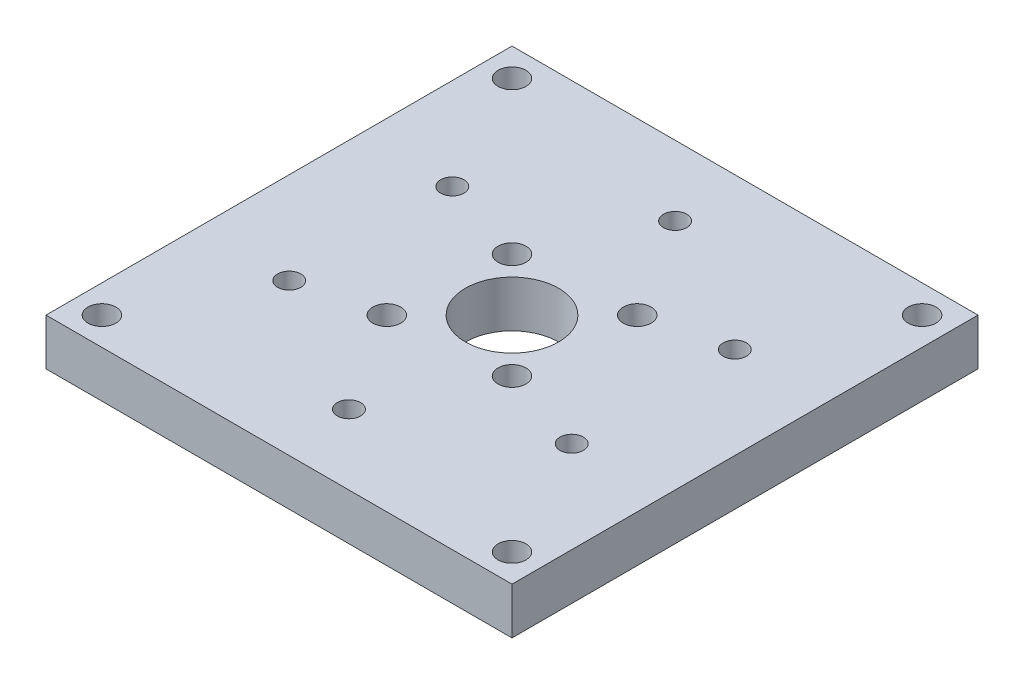
ISO-10303-21;
HEADER;
FILE_DESCRIPTION(('STEP AP214'),'2;1');
FILE_NAME('part.step','',(''),(''),'','','');
FILE_SCHEMA(('AUTOMOTIVE_DESIGN { 1 0 10303 214 1 1 1 1 }'));
ENDSEC;
DATA;
#1=APPLICATION_CONTEXT('core data for automotive mechanical design processes');
#2=APPLICATION_PROTOCOL_DEFINITION('international standard','automotive_design',2000,#1);
#3=PRODUCT_CONTEXT('',#1,'mechanical');
#4=PRODUCT('Part','Part','',(#3));
#5=PRODUCT_RELATED_PRODUCT_CATEGORY('part','',(#4));
#6=PRODUCT_DEFINITION_FORMATION('','',#4);
#7=PRODUCT_DEFINITION_CONTEXT('part definition',#1,'design');
#8=PRODUCT_DEFINITION('design','',#6,#7);
#9=PRODUCT_DEFINITION_SHAPE('','',#8);
#10=(LENGTH_UNIT() NAMED_UNIT(*) SI_UNIT(.MILLI.,.METRE.));
#11=(NAMED_UNIT(*) PLANE_ANGLE_UNIT() SI_UNIT($,.RADIAN.));
#12=(NAMED_UNIT(*) SI_UNIT($,.STERADIAN.) SOLID_ANGLE_UNIT());
#13=UNCERTAINTY_MEASURE_WITH_UNIT(LENGTH_MEASURE(1.E-05),#10,'distance_accuracy_value','');
#14=(GEOMETRIC_REPRESENTATION_CONTEXT(3) GLOBAL_UNCERTAINTY_ASSIGNED_CONTEXT((#13)) GLOBAL_UNIT_ASSIGNED_CONTEXT((#10,
#11,#12)) REPRESENTATION_CONTEXT('',''));
#15=CARTESIAN_POINT('',(0.,0.,0.));
#16=DIRECTION('',(0.,0.,1.));
#17=DIRECTION('',(1.,0.,0.));
#18=AXIS2_PLACEMENT_3D('',#15,#16,#17);
#19=CARTESIAN_POINT('',(0.,5.,-25.));
#20=DIRECTION('',(0.,0.,-1.));
#21=DIRECTION('',(-1.,0.,0.));
#22=AXIS2_PLACEMENT_3D('',#19,#20,#21);
#23=PLANE('',#22);
#24=DIRECTION('',(1.,0.,0.));
#25=VECTOR('',#24,1.);
#26=CARTESIAN_POINT('',(0.,0.,-25.));
#27=LINE('',#26,#25);
#28=CARTESIAN_POINT('',(-25.,0.,-25.));
#29=VERTEX_POINT('',#28);
#30=CARTESIAN_POINT('',(25.,0.,-25.));
#31=VERTEX_POINT('',#30);
#32=EDGE_CURVE('E123',#29,#31,#27,.T.);
#33=ORIENTED_EDGE('',*,*,#32,.F.);
#34=DIRECTION('',(0.,-1.,0.));
#35=VECTOR('',#34,1.);
#36=CARTESIAN_POINT('',(-25.,5.,-25.));
#37=LINE('',#36,#35);
#38=CARTESIAN_POINT('',(-25.,5.,-25.));
#39=VERTEX_POINT('',#38);
#40=EDGE_CURVE('E11',#39,#29,#37,.T.);
#41=ORIENTED_EDGE('',*,*,#40,.F.);
#42=DIRECTION('',(1.,0.,0.));
#43=VECTOR('',#42,1.);
#44=CARTESIAN_POINT('',(0.,5.,-25.));
#45=LINE('',#44,#43);
#46=CARTESIAN_POINT('',(25.,5.,-25.));
#47=VERTEX_POINT('',#46);
#48=EDGE_CURVE('E81',#39,#47,#45,.T.);
#49=ORIENTED_EDGE('',*,*,#48,.T.);
#50=DIRECTION('',(0.,-1.,0.));
#51=VECTOR('',#50,1.);
#52=CARTESIAN_POINT('',(25.,5.,-25.));
#53=LINE('',#52,#51);
#54=EDGE_CURVE('E39',#47,#31,#53,.T.);
#55=ORIENTED_EDGE('',*,*,#54,.T.);
#56=EDGE_LOOP('',(#33,#41,#49,#55));
#57=FACE_BOUND('',#56,.T.);
#58=ADVANCED_FACE('F17',(#57),#23,.T.);
#59=CARTESIAN_POINT('',(-25.,5.,0.));
#60=DIRECTION('',(1.,0.,0.));
#61=DIRECTION('',(0.,0.,-1.));
#62=AXIS2_PLACEMENT_3D('',#59,#60,#61);
#63=PLANE('',#62);
#64=DIRECTION('',(0.,0.,1.));
#65=VECTOR('',#64,1.);
#66=CARTESIAN_POINT('',(-25.,0.,0.));
#67=LINE('',#66,#65);
#68=CARTESIAN_POINT('',(-25.,0.,25.));
#69=VERTEX_POINT('',#68);
#70=EDGE_CURVE('E88',#29,#69,#67,.T.);
#71=ORIENTED_EDGE('',*,*,#70,.T.);
#72=DIRECTION('',(0.,-1.,0.));
#73=VECTOR('',#72,1.);
#74=CARTESIAN_POINT('',(-25.,5.,25.));
#75=LINE('',#74,#73);
#76=CARTESIAN_POINT('',(-25.,5.,25.));
#77=VERTEX_POINT('',#76);
#78=EDGE_CURVE('E26',#77,#69,#75,.T.);
#79=ORIENTED_EDGE('',*,*,#78,.F.);
#80=DIRECTION('',(0.,0.,1.));
#81=VECTOR('',#80,1.);
#82=CARTESIAN_POINT('',(-25.,5.,0.));
#83=LINE('',#82,#81);
#84=EDGE_CURVE('E74',#39,#77,#83,.T.);
#85=ORIENTED_EDGE('',*,*,#84,.F.);
#86=ORIENTED_EDGE('',*,*,#40,.T.);
#87=EDGE_LOOP('',(#71,#79,#85,#86));
#88=FACE_BOUND('',#87,.T.);
#89=ADVANCED_FACE('F86',(#88),#63,.F.);
#90=CARTESIAN_POINT('',(0.,5.,25.));
#91=DIRECTION('',(0.,0.,-1.));
#92=DIRECTION('',(-1.,0.,0.));
#93=AXIS2_PLACEMENT_3D('',#90,#91,#92);
#94=PLANE('',#93);
#95=DIRECTION('',(1.,0.,0.));
#96=VECTOR('',#95,1.);
#97=CARTESIAN_POINT('',(0.,0.,25.));
#98=LINE('',#97,#96);
#99=CARTESIAN_POINT('',(25.,0.,25.));
#100=VERTEX_POINT('',#99);
#101=EDGE_CURVE('E128',#69,#100,#98,.T.);
#102=ORIENTED_EDGE('',*,*,#101,.T.);
#103=DIRECTION('',(0.,-1.,0.));
#104=VECTOR('',#103,1.);
#105=CARTESIAN_POINT('',(25.,5.,25.));
#106=LINE('',#105,#104);
#107=CARTESIAN_POINT('',(25.,5.,25.));
#108=VERTEX_POINT('',#107);
#109=EDGE_CURVE('E58',#108,#100,#106,.T.);
#110=ORIENTED_EDGE('',*,*,#109,.F.);
#111=DIRECTION('',(1.,0.,0.));
#112=VECTOR('',#111,1.);
#113=CARTESIAN_POINT('',(0.,5.,25.));
#114=LINE('',#113,#112);
#115=EDGE_CURVE('E80',#77,#108,#114,.T.);
#116=ORIENTED_EDGE('',*,*,#115,.F.);
#117=ORIENTED_EDGE('',*,*,#78,.T.);
#118=EDGE_LOOP('',(#102,#110,#116,#117));
#119=FACE_BOUND('',#118,.T.);
#120=ADVANCED_FACE('F92',(#119),#94,.F.);
#121=CARTESIAN_POINT('',(5.65685424949238,5.,5.65685424949238));
#122=DIRECTION('',(0.,-1.,0.));
#123=DIRECTION('',(0.,0.,-1.));
#124=AXIS2_PLACEMENT_3D('',#121,#122,#123);
#125=CYLINDRICAL_SURFACE('',#124,1.5);
#126=CARTESIAN_POINT('',(5.65685424949238,5.,5.65685424949238));
#127=DIRECTION('',(0.,-1.,0.));
#128=DIRECTION('',(1.,0.,0.));
#129=AXIS2_PLACEMENT_3D('',#126,#127,#128);
#130=CIRCLE('',#129,1.5);
#131=CARTESIAN_POINT('',(7.15685424949238,5.,5.65685424949238));
#132=VERTEX_POINT('',#131);
#133=EDGE_CURVE('E115',#132,#132,#130,.T.);
#134=ORIENTED_EDGE('',*,*,#133,.F.);
#135=EDGE_LOOP('',(#134));
#136=FACE_BOUND('',#135,.T.);
#137=CARTESIAN_POINT('',(5.65685424949238,0.,5.65685424949238));
#138=DIRECTION('',(0.,-1.,0.));
#139=DIRECTION('',(1.,0.,0.));
#140=AXIS2_PLACEMENT_3D('',#137,#138,#139);
#141=CIRCLE('',#140,1.5);
#142=CARTESIAN_POINT('',(7.15685424949238,0.,5.65685424949238));
#143=VERTEX_POINT('',#142);
#144=EDGE_CURVE('E146',#143,#143,#141,.T.);
#145=ORIENTED_EDGE('',*,*,#144,.T.);
#146=EDGE_LOOP('',(#145));
#147=FACE_BOUND('',#146,.T.);
#148=ADVANCED_FACE('F308',(#136,#147),#125,.F.);
#149=CARTESIAN_POINT('',(6.7175144212722,5.,-6.7175144212722));
#150=DIRECTION('',(0.,-1.,0.));
#151=DIRECTION('',(0.,0.,-1.));
#152=AXIS2_PLACEMENT_3D('',#149,#150,#151);
#153=CYLINDRICAL_SURFACE('',#152,1.5);
#154=CARTESIAN_POINT('',(6.7175144212722,5.,-6.7175144212722));
#155=DIRECTION('',(0.,-1.,0.));
#156=DIRECTION('',(1.,0.,0.));
#157=AXIS2_PLACEMENT_3D('',#154,#155,#156);
#158=CIRCLE('',#157,1.5);
#159=CARTESIAN_POINT('',(8.2175144212722,5.,-6.7175144212722));
#160=VERTEX_POINT('',#159);
#161=EDGE_CURVE('E111',#160,#160,#158,.T.);
#162=ORIENTED_EDGE('',*,*,#161,.F.);
#163=EDGE_LOOP('',(#162));
#164=FACE_BOUND('',#163,.T.);
#165=CARTESIAN_POINT('',(6.7175144212722,0.,-6.7175144212722));
#166=DIRECTION('',(0.,-1.,0.));
#167=DIRECTION('',(1.,0.,0.));
#168=AXIS2_PLACEMENT_3D('',#165,#166,#167);
#169=CIRCLE('',#168,1.5);
#170=CARTESIAN_POINT('',(8.2175144212722,0.,-6.7175144212722));
#171=VERTEX_POINT('',#170);
#172=EDGE_CURVE('E142',#171,#171,#169,.T.);
#173=ORIENTED_EDGE('',*,*,#172,.T.);
#174=EDGE_LOOP('',(#173));
#175=FACE_BOUND('',#174,.T.);
#176=ADVANCED_FACE('F317',(#164,#175),#153,.F.);
#177=CARTESIAN_POINT('',(-6.7175144212722,5.,6.7175144212722));
#178=DIRECTION('',(0.,-1.,0.));
#179=DIRECTION('',(0.,0.,-1.));
#180=AXIS2_PLACEMENT_3D('',#177,#178,#179);
#181=CYLINDRICAL_SURFACE('',#180,1.5);
#182=CARTESIAN_POINT('',(-6.7175144212722,5.,6.7175144212722));
#183=DIRECTION('',(0.,-1.,0.));
#184=DIRECTION('',(1.,0.,0.));
#185=AXIS2_PLACEMENT_3D('',#182,#183,#184);
#186=CIRCLE('',#185,1.5);
#187=CARTESIAN_POINT('',(-5.2175144212722,5.,6.7175144212722));
#188=VERTEX_POINT('',#187);
#189=EDGE_CURVE('E107',#188,#188,#186,.T.);
#190=ORIENTED_EDGE('',*,*,#189,.F.);
#191=EDGE_LOOP('',(#190));
#192=FACE_BOUND('',#191,.T.);
#193=CARTESIAN_POINT('',(-6.7175144212722,0.,6.7175144212722));
#194=DIRECTION('',(0.,-1.,0.));
#195=DIRECTION('',(1.,0.,0.));
#196=AXIS2_PLACEMENT_3D('',#193,#194,#195);
#197=CIRCLE('',#196,1.5);
#198=CARTESIAN_POINT('',(-5.2175144212722,0.,6.7175144212722));
#199=VERTEX_POINT('',#198);
#200=EDGE_CURVE('E138',#199,#199,#197,.T.);
#201=ORIENTED_EDGE('',*,*,#200,.T.);
#202=EDGE_LOOP('',(#201));
#203=FACE_BOUND('',#202,.T.);
#204=ADVANCED_FACE('F313',(#192,#203),#181,.F.);
#205=CARTESIAN_POINT('',(0.,5.,0.));
#206=DIRECTION('',(0.,-1.,0.));
#207=DIRECTION('',(0.,0.,-1.));
#208=AXIS2_PLACEMENT_3D('',#205,#206,#207);
#209=CYLINDRICAL_SURFACE('',#208,5.);
#210=CARTESIAN_POINT('',(0.,5.,0.));
#211=DIRECTION('',(0.,1.,0.));
#212=DIRECTION('',(0.,0.,1.));
#213=AXIS2_PLACEMENT_3D('',#210,#211,#212);
#214=CIRCLE('',#213,5.);
#215=CARTESIAN_POINT('',(0.,5.,5.));
#216=VERTEX_POINT('',#215);
#217=EDGE_CURVE('E100',#216,#216,#214,.T.);
#218=ORIENTED_EDGE('',*,*,#217,.T.);
#219=EDGE_LOOP('',(#218));
#220=FACE_BOUND('',#219,.T.);
#221=CARTESIAN_POINT('',(0.,0.,0.));
#222=DIRECTION('',(0.,1.,0.));
#223=DIRECTION('',(0.,0.,1.));
#224=AXIS2_PLACEMENT_3D('',#221,#222,#223);
#225=CIRCLE('',#224,5.);
#226=CARTESIAN_POINT('',(0.,0.,5.));
#227=VERTEX_POINT('',#226);
#228=EDGE_CURVE('E134',#227,#227,#225,.T.);
#229=ORIENTED_EDGE('',*,*,#228,.F.);
#230=EDGE_LOOP('',(#229));
#231=FACE_BOUND('',#230,.T.);
#232=ADVANCED_FACE('F297',(#220,#231),#209,.F.);
#233=CARTESIAN_POINT('',(25.,5.,0.));
#234=DIRECTION('',(1.,0.,0.));
#235=DIRECTION('',(0.,0.,-1.));
#236=AXIS2_PLACEMENT_3D('',#233,#234,#235);
#237=PLANE('',#236);
#238=DIRECTION('',(0.,0.,1.));
#239=VECTOR('',#238,1.);
#240=CARTESIAN_POINT('',(25.,0.,0.));
#241=LINE('',#240,#239);
#242=EDGE_CURVE('E130',#31,#100,#241,.T.);
#243=ORIENTED_EDGE('',*,*,#242,.F.);
#244=ORIENTED_EDGE('',*,*,#54,.F.);
#245=DIRECTION('',(0.,0.,1.));
#246=VECTOR('',#245,1.);
#247=CARTESIAN_POINT('',(25.,5.,0.));
#248=LINE('',#247,#246);
#249=EDGE_CURVE('E94',#47,#108,#248,.T.);
#250=ORIENTED_EDGE('',*,*,#249,.T.);
#251=ORIENTED_EDGE('',*,*,#109,.T.);
#252=EDGE_LOOP('',(#243,#244,#250,#251));
#253=FACE_BOUND('',#252,.T.);
#254=ADVANCED_FACE('F287',(#253),#237,.T.);
#255=CARTESIAN_POINT('',(-5.65685424949238,5.,-5.65685424949239));
#256=DIRECTION('',(0.,-1.,0.));
#257=DIRECTION('',(0.,0.,-1.));
#258=AXIS2_PLACEMENT_3D('',#255,#256,#257);
#259=CYLINDRICAL_SURFACE('',#258,1.5);
#260=CARTESIAN_POINT('',(-5.65685424949238,5.,-5.65685424949239));
#261=DIRECTION('',(0.,-1.,0.));
#262=DIRECTION('',(1.,0.,0.));
#263=AXIS2_PLACEMENT_3D('',#260,#261,#262);
#264=CIRCLE('',#263,1.5);
#265=CARTESIAN_POINT('',(-4.15685424949238,5.,-5.65685424949239));
#266=VERTEX_POINT('',#265);
#267=EDGE_CURVE('E119',#266,#266,#264,.T.);
#268=ORIENTED_EDGE('',*,*,#267,.F.);
#269=EDGE_LOOP('',(#268));
#270=FACE_BOUND('',#269,.T.);
#271=CARTESIAN_POINT('',(-5.65685424949238,0.,-5.65685424949239));
#272=DIRECTION('',(0.,-1.,0.));
#273=DIRECTION('',(1.,0.,0.));
#274=AXIS2_PLACEMENT_3D('',#271,#272,#273);
#275=CIRCLE('',#274,1.5);
#276=CARTESIAN_POINT('',(-4.15685424949238,0.,-5.65685424949239));
#277=VERTEX_POINT('',#276);
#278=EDGE_CURVE('E150',#277,#277,#275,.T.);
#279=ORIENTED_EDGE('',*,*,#278,.T.);
#280=EDGE_LOOP('',(#279));
#281=FACE_BOUND('',#280,.T.);
#282=ADVANCED_FACE('F285',(#270,#281),#259,.F.);
#283=CARTESIAN_POINT('',(0.,5.,0.));
#284=DIRECTION('',(0.,1.,0.));
#285=DIRECTION('',(-1.,0.,0.));
#286=AXIS2_PLACEMENT_3D('',#283,#284,#285);
#287=PLANE('',#286);
#288=CARTESIAN_POINT('',(0.,5.,17.5));
#289=DIRECTION('',(0.,1.,0.));
#290=DIRECTION('',(0.,0.,1.));
#291=AXIS2_PLACEMENT_3D('',#288,#289,#290);
#292=CIRCLE('',#291,1.25);
#293=CARTESIAN_POINT('',(0.,5.,18.75));
#294=VERTEX_POINT('',#293);
#295=EDGE_CURVE('E193',#294,#294,#292,.T.);
#296=ORIENTED_EDGE('',*,*,#295,.F.);
#297=EDGE_LOOP('',(#296));
#298=FACE_BOUND('',#297,.T.);
#299=CARTESIAN_POINT('',(-15.1554445662277,5.,8.75));
#300=DIRECTION('',(0.,1.,0.));
#301=DIRECTION('',(0.,0.,1.));
#302=AXIS2_PLACEMENT_3D('',#299,#300,#301);
#303=CIRCLE('',#302,1.25);
#304=CARTESIAN_POINT('',(-15.1554445662277,5.,10.));
#305=VERTEX_POINT('',#304);
#306=EDGE_CURVE('E203',#305,#305,#303,.T.);
#307=ORIENTED_EDGE('',*,*,#306,.F.);
#308=EDGE_LOOP('',(#307));
#309=FACE_BOUND('',#308,.T.);
#310=CARTESIAN_POINT('',(-15.1554445662277,5.,-8.75));
#311=DIRECTION('',(0.,1.,0.));
#312=DIRECTION('',(0.,0.,1.));
#313=AXIS2_PLACEMENT_3D('',#310,#311,#312);
#314=CIRCLE('',#313,1.25);
#315=CARTESIAN_POINT('',(-15.1554445662277,5.,-7.5));
#316=VERTEX_POINT('',#315);
#317=EDGE_CURVE('E207',#316,#316,#314,.T.);
#318=ORIENTED_EDGE('',*,*,#317,.F.);
#319=EDGE_LOOP('',(#318));
#320=FACE_BOUND('',#319,.T.);
#321=CARTESIAN_POINT('',(0.,5.,-17.5));
#322=DIRECTION('',(0.,1.,0.));
#323=DIRECTION('',(0.,0.,1.));
#324=AXIS2_PLACEMENT_3D('',#321,#322,#323);
#325=CIRCLE('',#324,1.25);
#326=CARTESIAN_POINT('',(0.,5.,-16.25));
#327=VERTEX_POINT('',#326);
#328=EDGE_CURVE('E211',#327,#327,#325,.T.);
#329=ORIENTED_EDGE('',*,*,#328,.F.);
#330=EDGE_LOOP('',(#329));
#331=FACE_BOUND('',#330,.T.);
#332=CARTESIAN_POINT('',(15.1554445662277,5.,-8.75));
#333=DIRECTION('',(0.,1.,0.));
#334=DIRECTION('',(0.,0.,1.));
#335=AXIS2_PLACEMENT_3D('',#332,#333,#334);
#336=CIRCLE('',#335,1.25);
#337=CARTESIAN_POINT('',(15.1554445662277,5.,-7.5));
#338=VERTEX_POINT('',#337);
#339=EDGE_CURVE('E215',#338,#338,#336,.T.);
#340=ORIENTED_EDGE('',*,*,#339,.F.);
#341=EDGE_LOOP('',(#340));
#342=FACE_BOUND('',#341,.T.);
#343=CARTESIAN_POINT('',(15.1554445662277,5.,8.75));
#344=DIRECTION('',(0.,1.,0.));
#345=DIRECTION('',(0.,0.,1.));
#346=AXIS2_PLACEMENT_3D('',#343,#344,#345);
#347=CIRCLE('',#346,1.25);
#348=CARTESIAN_POINT('',(15.1554445662277,5.,10.));
#349=VERTEX_POINT('',#348);
#350=EDGE_CURVE('E219',#349,#349,#347,.T.);
#351=ORIENTED_EDGE('',*,*,#350,.F.);
#352=EDGE_LOOP('',(#351));
#353=FACE_BOUND('',#352,.T.);
#354=CARTESIAN_POINT('',(-22.,5.,-22.));
#355=DIRECTION('',(0.,1.,0.));
#356=DIRECTION('',(0.,0.,1.));
#357=AXIS2_PLACEMENT_3D('',#354,#355,#356);
#358=CIRCLE('',#357,1.5);
#359=CARTESIAN_POINT('',(-22.,5.,-20.5));
#360=VERTEX_POINT('',#359);
#361=EDGE_CURVE('E126',#360,#360,#358,.T.);
#362=ORIENTED_EDGE('',*,*,#361,.F.);
#363=EDGE_LOOP('',(#362));
#364=FACE_BOUND('',#363,.T.);
#365=CARTESIAN_POINT('',(22.,5.,-22.));
#366=DIRECTION('',(0.,1.,0.));
#367=DIRECTION('',(0.,0.,1.));
#368=AXIS2_PLACEMENT_3D('',#365,#366,#367);
#369=CIRCLE('',#368,1.5);
#370=CARTESIAN_POINT('',(22.,5.,-20.5));
#371=VERTEX_POINT('',#370);
#372=EDGE_CURVE('E171',#371,#371,#369,.T.);
#373=ORIENTED_EDGE('',*,*,#372,.F.);
#374=EDGE_LOOP('',(#373));
#375=FACE_BOUND('',#374,.T.);
#376=CARTESIAN_POINT('',(22.,5.,22.));
#377=DIRECTION('',(0.,1.,0.));
#378=DIRECTION('',(0.,0.,1.));
#379=AXIS2_PLACEMENT_3D('',#376,#377,#378);
#380=CIRCLE('',#379,1.5);
#381=CARTESIAN_POINT('',(22.,5.,23.5));
#382=VERTEX_POINT('',#381);
#383=EDGE_CURVE('E175',#382,#382,#380,.T.);
#384=ORIENTED_EDGE('',*,*,#383,.F.);
#385=EDGE_LOOP('',(#384));
#386=FACE_BOUND('',#385,.T.);
#387=CARTESIAN_POINT('',(-22.,5.,22.));
#388=DIRECTION('',(0.,1.,0.));
#389=DIRECTION('',(0.,0.,1.));
#390=AXIS2_PLACEMENT_3D('',#387,#388,#389);
#391=CIRCLE('',#390,1.5);
#392=CARTESIAN_POINT('',(-22.,5.,23.5));
#393=VERTEX_POINT('',#392);
#394=EDGE_CURVE('E179',#393,#393,#391,.T.);
#395=ORIENTED_EDGE('',*,*,#394,.F.);
#396=EDGE_LOOP('',(#395));
#397=FACE_BOUND('',#396,.T.);
#398=ORIENTED_EDGE('',*,*,#48,.F.);
#399=ORIENTED_EDGE('',*,*,#84,.T.);
#400=ORIENTED_EDGE('',*,*,#115,.T.);
#401=ORIENTED_EDGE('',*,*,#249,.F.);
#402=EDGE_LOOP('',(#398,#399,#400,#401));
#403=FACE_BOUND('',#402,.T.);
#404=ORIENTED_EDGE('',*,*,#217,.F.);
#405=EDGE_LOOP('',(#404));
#406=FACE_BOUND('',#405,.T.);
#407=ORIENTED_EDGE('',*,*,#189,.T.);
#408=EDGE_LOOP('',(#407));
#409=FACE_BOUND('',#408,.T.);
#410=ORIENTED_EDGE('',*,*,#161,.T.);
#411=EDGE_LOOP('',(#410));
#412=FACE_BOUND('',#411,.T.);
#413=ORIENTED_EDGE('',*,*,#133,.T.);
#414=EDGE_LOOP('',(#413));
#415=FACE_BOUND('',#414,.T.);
#416=ORIENTED_EDGE('',*,*,#267,.T.);
#417=EDGE_LOOP('',(#416));
#418=FACE_BOUND('',#417,.T.);
#419=ADVANCED_FACE('F76',(#298,#309,#320,#331,#342,#353,#364,#375,#386,#397,#403,#406,#409,#412,
#415,#418),#287,.T.);
#420=CARTESIAN_POINT('',(0.,0.,0.));
#421=DIRECTION('',(0.,1.,0.));
#422=DIRECTION('',(-1.,0.,0.));
#423=AXIS2_PLACEMENT_3D('',#420,#421,#422);
#424=PLANE('',#423);
#425=CARTESIAN_POINT('',(0.,0.,17.5));
#426=DIRECTION('',(0.,1.,0.));
#427=DIRECTION('',(0.,0.,1.));
#428=AXIS2_PLACEMENT_3D('',#425,#426,#427);
#429=CIRCLE('',#428,1.25);
#430=CARTESIAN_POINT('',(0.,0.,18.75));
#431=VERTEX_POINT('',#430);
#432=EDGE_CURVE('E223',#431,#431,#429,.F.);
#433=ORIENTED_EDGE('',*,*,#432,.F.);
#434=EDGE_LOOP('',(#433));
#435=FACE_BOUND('',#434,.T.);
#436=CARTESIAN_POINT('',(-15.1554445662277,0.,8.75));
#437=DIRECTION('',(0.,1.,0.));
#438=DIRECTION('',(0.,0.,1.));
#439=AXIS2_PLACEMENT_3D('',#436,#437,#438);
#440=CIRCLE('',#439,1.25);
#441=CARTESIAN_POINT('',(-15.1554445662277,0.,10.));
#442=VERTEX_POINT('',#441);
#443=EDGE_CURVE('E229',#442,#442,#440,.F.);
#444=ORIENTED_EDGE('',*,*,#443,.F.);
#445=EDGE_LOOP('',(#444));
#446=FACE_BOUND('',#445,.T.);
#447=CARTESIAN_POINT('',(-15.1554445662277,0.,-8.75));
#448=DIRECTION('',(0.,1.,0.));
#449=DIRECTION('',(0.,0.,1.));
#450=AXIS2_PLACEMENT_3D('',#447,#448,#449);
#451=CIRCLE('',#450,1.25);
#452=CARTESIAN_POINT('',(-15.1554445662277,0.,-7.5));
#453=VERTEX_POINT('',#452);
#454=EDGE_CURVE('E224',#453,#453,#451,.F.);
#455=ORIENTED_EDGE('',*,*,#454,.F.);
#456=EDGE_LOOP('',(#455));
#457=FACE_BOUND('',#456,.T.);
#458=CARTESIAN_POINT('',(0.,0.,-17.5));
#459=DIRECTION('',(0.,1.,0.));
#460=DIRECTION('',(0.,0.,1.));
#461=AXIS2_PLACEMENT_3D('',#458,#459,#460);
#462=CIRCLE('',#461,1.25);
#463=CARTESIAN_POINT('',(0.,0.,-16.25));
#464=VERTEX_POINT('',#463);
#465=EDGE_CURVE('E228',#464,#464,#462,.F.);
#466=ORIENTED_EDGE('',*,*,#465,.F.);
#467=EDGE_LOOP('',(#466));
#468=FACE_BOUND('',#467,.T.);
#469=CARTESIAN_POINT('',(15.1554445662277,0.,-8.75));
#470=DIRECTION('',(0.,1.,0.));
#471=DIRECTION('',(0.,0.,1.));
#472=AXIS2_PLACEMENT_3D('',#469,#470,#471);
#473=CIRCLE('',#472,1.25);
#474=CARTESIAN_POINT('',(15.1554445662277,0.,-7.5));
#475=VERTEX_POINT('',#474);
#476=EDGE_CURVE('E233',#475,#475,#473,.F.);
#477=ORIENTED_EDGE('',*,*,#476,.F.);
#478=EDGE_LOOP('',(#477));
#479=FACE_BOUND('',#478,.T.);
#480=CARTESIAN_POINT('',(15.1554445662277,0.,8.75));
#481=DIRECTION('',(0.,1.,0.));
#482=DIRECTION('',(0.,0.,1.));
#483=AXIS2_PLACEMENT_3D('',#480,#481,#482);
#484=CIRCLE('',#483,1.25);
#485=CARTESIAN_POINT('',(15.1554445662277,0.,10.));
#486=VERTEX_POINT('',#485);
#487=EDGE_CURVE('E237',#486,#486,#484,.F.);
#488=ORIENTED_EDGE('',*,*,#487,.F.);
#489=EDGE_LOOP('',(#488));
#490=FACE_BOUND('',#489,.T.);
#491=CARTESIAN_POINT('',(-22.,0.,-22.));
#492=DIRECTION('',(0.,-1.,0.));
#493=DIRECTION('',(0.,0.,-1.));
#494=AXIS2_PLACEMENT_3D('',#491,#492,#493);
#495=CIRCLE('',#494,1.5);
#496=CARTESIAN_POINT('',(-22.,0.,-23.5));
#497=VERTEX_POINT('',#496);
#498=EDGE_CURVE('E188',#497,#497,#495,.T.);
#499=ORIENTED_EDGE('',*,*,#498,.F.);
#500=EDGE_LOOP('',(#499));
#501=FACE_BOUND('',#500,.T.);
#502=CARTESIAN_POINT('',(22.,0.,-22.));
#503=DIRECTION('',(0.,-1.,0.));
#504=DIRECTION('',(0.,0.,-1.));
#505=AXIS2_PLACEMENT_3D('',#502,#503,#504);
#506=CIRCLE('',#505,1.5);
#507=CARTESIAN_POINT('',(22.,0.,-23.5));
#508=VERTEX_POINT('',#507);
#509=EDGE_CURVE('E192',#508,#508,#506,.T.);
#510=ORIENTED_EDGE('',*,*,#509,.F.);
#511=EDGE_LOOP('',(#510));
#512=FACE_BOUND('',#511,.T.);
#513=CARTESIAN_POINT('',(22.,0.,22.));
#514=DIRECTION('',(0.,-1.,0.));
#515=DIRECTION('',(0.,0.,-1.));
#516=AXIS2_PLACEMENT_3D('',#513,#514,#515);
#517=CIRCLE('',#516,1.5);
#518=CARTESIAN_POINT('',(22.,0.,20.5));
#519=VERTEX_POINT('',#518);
#520=EDGE_CURVE('E187',#519,#519,#517,.T.);
#521=ORIENTED_EDGE('',*,*,#520,.F.);
#522=EDGE_LOOP('',(#521));
#523=FACE_BOUND('',#522,.T.);
#524=CARTESIAN_POINT('',(-22.,0.,22.));
#525=DIRECTION('',(0.,-1.,0.));
#526=DIRECTION('',(0.,0.,-1.));
#527=AXIS2_PLACEMENT_3D('',#524,#525,#526);
#528=CIRCLE('',#527,1.5);
#529=CARTESIAN_POINT('',(-22.,0.,20.5));
#530=VERTEX_POINT('',#529);
#531=EDGE_CURVE('E183',#530,#530,#528,.T.);
#532=ORIENTED_EDGE('',*,*,#531,.F.);
#533=EDGE_LOOP('',(#532));
#534=FACE_BOUND('',#533,.T.);
#535=ORIENTED_EDGE('',*,*,#32,.T.);
#536=ORIENTED_EDGE('',*,*,#242,.T.);
#537=ORIENTED_EDGE('',*,*,#101,.F.);
#538=ORIENTED_EDGE('',*,*,#70,.F.);
#539=EDGE_LOOP('',(#535,#536,#537,#538));
#540=FACE_BOUND('',#539,.T.);
#541=ORIENTED_EDGE('',*,*,#228,.T.);
#542=EDGE_LOOP('',(#541));
#543=FACE_BOUND('',#542,.T.);
#544=ORIENTED_EDGE('',*,*,#200,.F.);
#545=EDGE_LOOP('',(#544));
#546=FACE_BOUND('',#545,.T.);
#547=ORIENTED_EDGE('',*,*,#172,.F.);
#548=EDGE_LOOP('',(#547));
#549=FACE_BOUND('',#548,.T.);
#550=ORIENTED_EDGE('',*,*,#144,.F.);
#551=EDGE_LOOP('',(#550));
#552=FACE_BOUND('',#551,.T.);
#553=ORIENTED_EDGE('',*,*,#278,.F.);
#554=EDGE_LOOP('',(#553));
#555=FACE_BOUND('',#554,.T.);
#556=ADVANCED_FACE('F251',(#435,#446,#457,#468,#479,#490,#501,#512,#523,#534,#540,#543,#546,
#549,#552,#555),#424,.F.);
#557=CARTESIAN_POINT('',(-22.,85.755262259789,22.));
#558=DIRECTION('',(0.,-1.,0.));
#559=DIRECTION('',(0.,0.,-1.));
#560=AXIS2_PLACEMENT_3D('',#557,#558,#559);
#561=CYLINDRICAL_SURFACE('',#560,1.5);
#562=ORIENTED_EDGE('',*,*,#394,.T.);
#563=EDGE_LOOP('',(#562));
#564=FACE_BOUND('',#563,.T.);
#565=ORIENTED_EDGE('',*,*,#531,.T.);
#566=EDGE_LOOP('',(#565));
#567=FACE_BOUND('',#566,.T.);
#568=ADVANCED_FACE('F254',(#564,#567),#561,.F.);
#569=CARTESIAN_POINT('',(22.,85.755262259789,22.));
#570=DIRECTION('',(0.,-1.,0.));
#571=DIRECTION('',(0.,0.,-1.));
#572=AXIS2_PLACEMENT_3D('',#569,#570,#571);
#573=CYLINDRICAL_SURFACE('',#572,1.5);
#574=ORIENTED_EDGE('',*,*,#383,.T.);
#575=EDGE_LOOP('',(#574));
#576=FACE_BOUND('',#575,.T.);
#577=ORIENTED_EDGE('',*,*,#520,.T.);
#578=EDGE_LOOP('',(#577));
#579=FACE_BOUND('',#578,.T.);
#580=ADVANCED_FACE('F381',(#576,#579),#573,.F.);
#581=CARTESIAN_POINT('',(22.,85.755262259789,-22.));
#582=DIRECTION('',(0.,-1.,0.));
#583=DIRECTION('',(0.,0.,-1.));
#584=AXIS2_PLACEMENT_3D('',#581,#582,#583);
#585=CYLINDRICAL_SURFACE('',#584,1.5);
#586=ORIENTED_EDGE('',*,*,#372,.T.);
#587=EDGE_LOOP('',(#586));
#588=FACE_BOUND('',#587,.T.);
#589=ORIENTED_EDGE('',*,*,#509,.T.);
#590=EDGE_LOOP('',(#589));
#591=FACE_BOUND('',#590,.T.);
#592=ADVANCED_FACE('F392',(#588,#591),#585,.F.);
#593=CARTESIAN_POINT('',(-22.,85.755262259789,-22.));
#594=DIRECTION('',(0.,-1.,0.));
#595=DIRECTION('',(0.,0.,-1.));
#596=AXIS2_PLACEMENT_3D('',#593,#594,#595);
#597=CYLINDRICAL_SURFACE('',#596,1.5);
#598=ORIENTED_EDGE('',*,*,#361,.T.);
#599=EDGE_LOOP('',(#598));
#600=FACE_BOUND('',#599,.T.);
#601=ORIENTED_EDGE('',*,*,#498,.T.);
#602=EDGE_LOOP('',(#601));
#603=FACE_BOUND('',#602,.T.);
#604=ADVANCED_FACE('F403',(#600,#603),#597,.F.);
#605=CARTESIAN_POINT('',(15.1554445662277,-0.002000000000002,8.75));
#606=DIRECTION('',(0.,1.,0.));
#607=DIRECTION('',(0.,0.,1.));
#608=AXIS2_PLACEMENT_3D('',#605,#606,#607);
#609=CYLINDRICAL_SURFACE('',#608,1.25);
#610=ORIENTED_EDGE('',*,*,#350,.T.);
#611=EDGE_LOOP('',(#610));
#612=FACE_BOUND('',#611,.T.);
#613=ORIENTED_EDGE('',*,*,#487,.T.);
#614=EDGE_LOOP('',(#613));
#615=FACE_BOUND('',#614,.T.);
#616=ADVANCED_FACE('F414',(#612,#615),#609,.F.);
#617=CARTESIAN_POINT('',(15.1554445662277,-0.002000000000002,-8.75));
#618=DIRECTION('',(0.,1.,0.));
#619=DIRECTION('',(0.,0.,1.));
#620=AXIS2_PLACEMENT_3D('',#617,#618,#619);
#621=CYLINDRICAL_SURFACE('',#620,1.25);
#622=ORIENTED_EDGE('',*,*,#339,.T.);
#623=EDGE_LOOP('',(#622));
#624=FACE_BOUND('',#623,.T.);
#625=ORIENTED_EDGE('',*,*,#476,.T.);
#626=EDGE_LOOP('',(#625));
#627=FACE_BOUND('',#626,.T.);
#628=ADVANCED_FACE('F425',(#624,#627),#621,.F.);
#629=CARTESIAN_POINT('',(0.,-0.002000000000002,-17.5));
#630=DIRECTION('',(0.,1.,0.));
#631=DIRECTION('',(0.,0.,1.));
#632=AXIS2_PLACEMENT_3D('',#629,#630,#631);
#633=CYLINDRICAL_SURFACE('',#632,1.25);
#634=ORIENTED_EDGE('',*,*,#328,.T.);
#635=EDGE_LOOP('',(#634));
#636=FACE_BOUND('',#635,.T.);
#637=ORIENTED_EDGE('',*,*,#465,.T.);
#638=EDGE_LOOP('',(#637));
#639=FACE_BOUND('',#638,.T.);
#640=ADVANCED_FACE('F436',(#636,#639),#633,.F.);
#641=CARTESIAN_POINT('',(-15.1554445662277,-0.002000000000002,-8.75));
#642=DIRECTION('',(0.,1.,0.));
#643=DIRECTION('',(0.,0.,1.));
#644=AXIS2_PLACEMENT_3D('',#641,#642,#643);
#645=CYLINDRICAL_SURFACE('',#644,1.25);
#646=ORIENTED_EDGE('',*,*,#317,.T.);
#647=EDGE_LOOP('',(#646));
#648=FACE_BOUND('',#647,.T.);
#649=ORIENTED_EDGE('',*,*,#454,.T.);
#650=EDGE_LOOP('',(#649));
#651=FACE_BOUND('',#650,.T.);
#652=ADVANCED_FACE('F447',(#648,#651),#645,.F.);
#653=CARTESIAN_POINT('',(-15.1554445662277,-0.002000000000002,8.75));
#654=DIRECTION('',(0.,1.,0.));
#655=DIRECTION('',(0.,0.,1.));
#656=AXIS2_PLACEMENT_3D('',#653,#654,#655);
#657=CYLINDRICAL_SURFACE('',#656,1.25);
#658=ORIENTED_EDGE('',*,*,#306,.T.);
#659=EDGE_LOOP('',(#658));
#660=FACE_BOUND('',#659,.T.);
#661=ORIENTED_EDGE('',*,*,#443,.T.);
#662=EDGE_LOOP('',(#661));
#663=FACE_BOUND('',#662,.T.);
#664=ADVANCED_FACE('F458',(#660,#663),#657,.F.);
#665=CARTESIAN_POINT('',(0.,-0.002000000000002,17.5));
#666=DIRECTION('',(0.,1.,0.));
#667=DIRECTION('',(0.,0.,1.));
#668=AXIS2_PLACEMENT_3D('',#665,#666,#667);
#669=CYLINDRICAL_SURFACE('',#668,1.25);
#670=ORIENTED_EDGE('',*,*,#295,.T.);
#671=EDGE_LOOP('',(#670));
#672=FACE_BOUND('',#671,.T.);
#673=ORIENTED_EDGE('',*,*,#432,.T.);
#674=EDGE_LOOP('',(#673));
#675=FACE_BOUND('',#674,.T.);
#676=ADVANCED_FACE('F249',(#672,#675),#669,.F.);
#677=CLOSED_SHELL('',(#58,#89,#120,#148,#176,#204,#232,#254,#282,#419,#556,#568,#580,#592,#604,
#616,#628,#640,#652,#664,#676));
#678=MANIFOLD_SOLID_BREP('B1',#677);
#679=ADVANCED_BREP_SHAPE_REPRESENTATION('',(#18,#678),#14);
#680=SHAPE_DEFINITION_REPRESENTATION(#9,#679);
ENDSEC;
END-ISO-10303-21;
